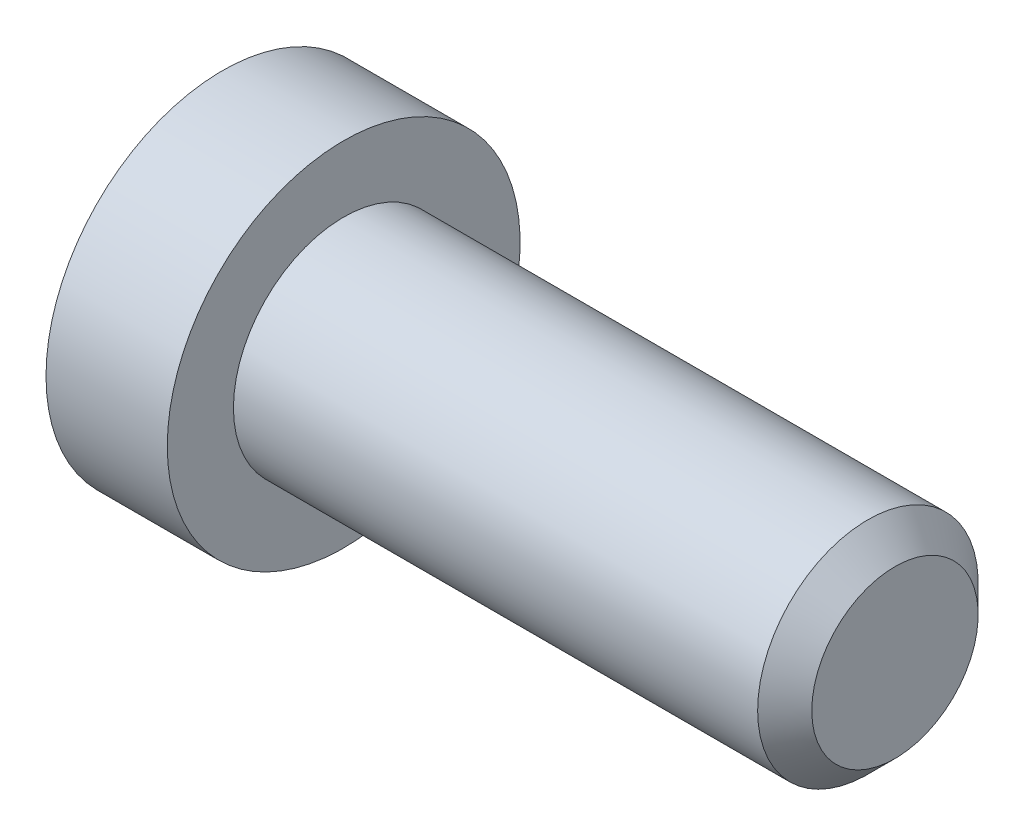
ISO-10303-21;
HEADER;
FILE_DESCRIPTION(('STEP AP214'),'2;1');
FILE_NAME('part.step','',(''),(''),'','','');
FILE_SCHEMA(('AUTOMOTIVE_DESIGN { 1 0 10303 214 1 1 1 1 }'));
ENDSEC;
DATA;
#1=APPLICATION_CONTEXT('core data for automotive mechanical design processes');
#2=APPLICATION_PROTOCOL_DEFINITION('international standard','automotive_design',2000,#1);
#3=PRODUCT_CONTEXT('',#1,'mechanical');
#4=PRODUCT('Part','Part','',(#3));
#5=PRODUCT_RELATED_PRODUCT_CATEGORY('part','',(#4));
#6=PRODUCT_DEFINITION_FORMATION('','',#4);
#7=PRODUCT_DEFINITION_CONTEXT('part definition',#1,'design');
#8=PRODUCT_DEFINITION('design','',#6,#7);
#9=PRODUCT_DEFINITION_SHAPE('','',#8);
#10=(LENGTH_UNIT() NAMED_UNIT(*) SI_UNIT(.MILLI.,.METRE.));
#11=(NAMED_UNIT(*) PLANE_ANGLE_UNIT() SI_UNIT($,.RADIAN.));
#12=(NAMED_UNIT(*) SI_UNIT($,.STERADIAN.) SOLID_ANGLE_UNIT());
#13=UNCERTAINTY_MEASURE_WITH_UNIT(LENGTH_MEASURE(1.E-05),#10,'distance_accuracy_value','');
#14=(GEOMETRIC_REPRESENTATION_CONTEXT(3) GLOBAL_UNCERTAINTY_ASSIGNED_CONTEXT((#13)) GLOBAL_UNIT_ASSIGNED_CONTEXT((#10,
#11,#12)) REPRESENTATION_CONTEXT('',''));
#15=CARTESIAN_POINT('',(0.,0.,0.));
#16=DIRECTION('',(0.,0.,1.));
#17=DIRECTION('',(1.,0.,0.));
#18=AXIS2_PLACEMENT_3D('',#15,#16,#17);
#19=CARTESIAN_POINT('',(-0.97,0.,0.));
#20=DIRECTION('',(-1.,0.,0.));
#21=DIRECTION('',(0.,0.,1.));
#22=AXIS2_PLACEMENT_3D('',#19,#20,#21);
#23=CONICAL_SURFACE('',#22,0.65,0.785398163397449);
#24=CARTESIAN_POINT('',(-1.1,0.,0.));
#25=DIRECTION('',(-1.,0.,0.));
#26=DIRECTION('',(0.,0.,1.));
#27=AXIS2_PLACEMENT_3D('',#24,#25,#26);
#28=CIRCLE('',#27,0.78);
#29=CARTESIAN_POINT('',(-1.1,0.,0.78));
#30=VERTEX_POINT('',#29);
#31=EDGE_CURVE('E227',#30,#30,#28,.T.);
#32=ORIENTED_EDGE('',*,*,#31,.T.);
#33=EDGE_LOOP('',(#32));
#34=FACE_BOUND('',#33,.T.);
#35=CARTESIAN_POINT('',(-1.07067084664318,0.750670820000348,-0.000200000000000034));
#36=CARTESIAN_POINT('',(-1.05777271213806,0.73776480399612,0.0221538754426204));
#37=CARTESIAN_POINT('',(-1.04563050484515,0.724643800275744,0.044880120532612));
#38=CARTESIAN_POINT('',(-1.02339759480874,0.697888312556701,0.0912219846432812));
#39=CARTESIAN_POINT('',(-1.01331927475652,0.684251279339144,0.114842019040595));
#40=CARTESIAN_POINT('',(-0.996056866369887,0.656751052753346,0.162473808706854));
#41=CARTESIAN_POINT('',(-0.988829308462092,0.642894902702,0.186473364593084));
#42=CARTESIAN_POINT('',(-0.97768455194652,0.614884150684731,0.234989410245206));
#43=CARTESIAN_POINT('',(-0.973759052568381,0.600730389323031,0.259504444041877));
#44=CARTESIAN_POINT('',(-0.96877878728122,0.566158679282904,0.319384402335916));
#45=CARTESIAN_POINT('',(-0.969679834739171,0.545659978891344,0.354889192903231));
#46=CARTESIAN_POINT('',(-0.978963911263182,0.505092254718528,0.42515455231799));
#47=CARTESIAN_POINT('',(-0.98735811297617,0.485023918403328,0.459913930439298));
#48=CARTESIAN_POINT('',(-1.00760102845381,0.449779956850421,0.520958262508936));
#49=CARTESIAN_POINT('',(-1.01839377321102,0.434442301170774,0.547523861415083));
#50=CARTESIAN_POINT('',(-1.04270728139612,0.404367956205631,0.599614154899066));
#51=CARTESIAN_POINT('',(-1.0562191709538,0.389629494831163,0.625141918825035));
#52=CARTESIAN_POINT('',(-1.07067084664319,0.375162204919422,0.6502));
#53=B_SPLINE_CURVE_WITH_KNOTS('',3,(#35,#36,#37,#38,#39,#40,#41,#42,#43,#44,#45,#46,#47,#48,#49,
#50,#51,#52),.UNSPECIFIED.,.F.,.F.,(4,2,2,2,2,2,2,2,4),(0.,0.0866236559063428,0.173752711623239,
0.259496442803563,0.345023980281746,0.467267720550118,0.589694037029328,0.687111308755475,
0.784215671813662),.UNSPECIFIED.);
#54=CARTESIAN_POINT('',(-1.07055534994651,0.75055534994651,0.));
#55=VERTEX_POINT('',#54);
#56=CARTESIAN_POINT('',(-1.07055534994651,0.37527767497326,0.65));
#57=VERTEX_POINT('',#56);
#58=EDGE_CURVE('E54',#55,#57,#53,.T.);
#59=ORIENTED_EDGE('',*,*,#58,.T.);
#60=CARTESIAN_POINT('',(-1.34698657134254,-0.795110946797934,0.65));
#61=CARTESIAN_POINT('',(-1.33215114259725,-0.775946306003986,0.65));
#62=CARTESIAN_POINT('',(-1.3174472939133,-0.756680121115909,0.65));
#63=CARTESIAN_POINT('',(-1.28835841074634,-0.717901876989154,0.65));
#64=CARTESIAN_POINT('',(-1.27397345032455,-0.6983897622505,0.65));
#65=CARTESIAN_POINT('',(-1.23117506241516,-0.639135200540149,0.65));
#66=CARTESIAN_POINT('',(-1.20334527350157,-0.598964394147309,0.65));
#67=CARTESIAN_POINT('',(-1.14826198934892,-0.514410757724497,0.65));
#68=CARTESIAN_POINT('',(-1.12116572431861,-0.46992440441247,0.65));
#69=CARTESIAN_POINT('',(-1.0712919728277,-0.378677329688828,0.65));
#70=CARTESIAN_POINT('',(-1.04849990079042,-0.331924989534033,0.65));
#71=CARTESIAN_POINT('',(-1.02060578904515,-0.262171836183639,0.65));
#72=CARTESIAN_POINT('',(-1.01268451768127,-0.240308902088551,0.65));
#73=CARTESIAN_POINT('',(-0.998588372872614,-0.196027368820283,0.65));
#74=CARTESIAN_POINT('',(-0.992413608004518,-0.173608735194612,0.65));
#75=CARTESIAN_POINT('',(-0.977262665972014,-0.106507355653642,0.65));
#76=CARTESIAN_POINT('',(-0.971270973089183,-0.0610734931701748,0.65));
#77=CARTESIAN_POINT('',(-0.96914985793265,0.0279224529824405,0.65));
#78=CARTESIAN_POINT('',(-0.972574981246003,0.0714733819315436,0.65));
#79=CARTESIAN_POINT('',(-0.983733142695104,0.136066508476408,0.65));
#80=CARTESIAN_POINT('',(-0.988531386792264,0.157677342437972,0.65));
#81=CARTESIAN_POINT('',(-0.999890236201741,0.20043000731548,0.65));
#82=CARTESIAN_POINT('',(-1.00645075830175,0.221571860325033,0.65));
#83=CARTESIAN_POINT('',(-1.02901876039986,0.286168508724034,0.65));
#84=CARTESIAN_POINT('',(-1.04751312457459,0.328748789016924,0.65));
#85=CARTESIAN_POINT('',(-1.08868123081028,0.411924938969468,0.65));
#86=CARTESIAN_POINT('',(-1.11136960894874,0.45251320906933,0.65));
#87=CARTESIAN_POINT('',(-1.15821231122604,0.530105416888655,0.65));
#88=CARTESIAN_POINT('',(-1.18223949226305,0.567187443274161,0.65));
#89=CARTESIAN_POINT('',(-1.23177090042578,0.639922078553566,0.65));
#90=CARTESIAN_POINT('',(-1.25726166991636,0.675583795890087,0.65));
#91=CARTESIAN_POINT('',(-1.28322807013493,0.710850416821895,0.65));
#92=B_SPLINE_CURVE_WITH_KNOTS('',3,(#60,#61,#62,#63,#64,#65,#66,#67,#68,#69,#70,#71,#72,#73,#74,
#75,#76,#77,#78,#79,#80,#81,#82,#83,#84,#85,#86,#87,#88,#89,#90,#91),.UNSPECIFIED.,.F.,.F.,(4,2,
2,2,2,2,2,2,2,2,2,2,2,2,2,4),(0.,0.0727056779992604,0.145428068505781,0.291977039828534,
0.44812796117937,0.603739848023543,0.673436680579368,0.743137845090119,0.879622453379847,
1.00976325017061,1.0761088480166,1.14245131366665,1.28132126625575,1.42068531737679,
1.55318895886601,1.68462520727467),.UNSPECIFIED.);
#93=CARTESIAN_POINT('',(-1.07055534994652,-0.37527767497326,0.65));
#94=VERTEX_POINT('',#93);
#95=EDGE_CURVE('E196',#57,#94,#92,.F.);
#96=ORIENTED_EDGE('',*,*,#95,.T.);
#97=CARTESIAN_POINT('',(-1.07067084664319,-0.375162204919422,0.6502));
#98=CARTESIAN_POINT('',(-1.05777271213806,-0.38806822092365,0.627846124557379));
#99=CARTESIAN_POINT('',(-1.04563050484515,-0.401189224644026,0.605119879467387));
#100=CARTESIAN_POINT('',(-1.02339759480874,-0.427944712363071,0.558778015356717));
#101=CARTESIAN_POINT('',(-1.01331927475652,-0.441581745580628,0.535157980959402));
#102=CARTESIAN_POINT('',(-0.996056866369889,-0.469081972166426,0.487526191293143));
#103=CARTESIAN_POINT('',(-0.988829308462093,-0.482938122217773,0.463526635406912));
#104=CARTESIAN_POINT('',(-0.97768455194652,-0.510948874235042,0.415010589754788));
#105=CARTESIAN_POINT('',(-0.973759052568381,-0.525102635596743,0.390495555958116));
#106=CARTESIAN_POINT('',(-0.96877878728122,-0.55967434563687,0.330615597664077));
#107=CARTESIAN_POINT('',(-0.969679834739171,-0.58017304602843,0.295110807096762));
#108=CARTESIAN_POINT('',(-0.978963911263182,-0.620740770201247,0.224845447682002));
#109=CARTESIAN_POINT('',(-0.987358112976169,-0.640809106516447,0.190086069560695));
#110=CARTESIAN_POINT('',(-1.00760102845381,-0.676053068069352,0.129041737491058));
#111=CARTESIAN_POINT('',(-1.01839377321101,-0.691390723748998,0.102476138584913));
#112=CARTESIAN_POINT('',(-1.04270728139611,-0.721465068714141,0.0503858451009323));
#113=CARTESIAN_POINT('',(-1.0562191709538,-0.736203530088608,0.0248580811749638));
#114=CARTESIAN_POINT('',(-1.07067084664318,-0.750670820000348,-0.000200000000000006));
#115=B_SPLINE_CURVE_WITH_KNOTS('',3,(#97,#98,#99,#100,#101,#102,#103,#104,#105,#106,#107,#108,
#109,#110,#111,#112,#113,#114),.UNSPECIFIED.,.F.,.F.,(4,2,2,2,2,2,2,2,4),(0.,0.086623655906345,
0.173752711623244,0.25949644280357,0.345023980281755,0.467267720550128,0.589694037029338,
0.68711130875548,0.784215671813662),.UNSPECIFIED.);
#116=CARTESIAN_POINT('',(-1.07055534994651,-0.75055534994651,0.));
#117=VERTEX_POINT('',#116);
#118=EDGE_CURVE('E140',#94,#117,#115,.T.);
#119=ORIENTED_EDGE('',*,*,#118,.T.);
#120=CARTESIAN_POINT('',(-1.07067084664318,-0.750670820000348,0.000200000000000034));
#121=CARTESIAN_POINT('',(-1.05777271213806,-0.73776480399612,-0.0221538754426204));
#122=CARTESIAN_POINT('',(-1.04563050484515,-0.724643800275744,-0.044880120532612));
#123=CARTESIAN_POINT('',(-1.02339759480874,-0.697888312556701,-0.0912219846432812));
#124=CARTESIAN_POINT('',(-1.01331927475652,-0.684251279339144,-0.114842019040595));
#125=CARTESIAN_POINT('',(-0.996056866369887,-0.656751052753346,-0.162473808706854));
#126=CARTESIAN_POINT('',(-0.988829308462092,-0.642894902702,-0.186473364593084));
#127=CARTESIAN_POINT('',(-0.97768455194652,-0.614884150684731,-0.234989410245206));
#128=CARTESIAN_POINT('',(-0.973759052568381,-0.600730389323031,-0.259504444041877));
#129=CARTESIAN_POINT('',(-0.96877878728122,-0.566158679282904,-0.319384402335916));
#130=CARTESIAN_POINT('',(-0.969679834739171,-0.545659978891344,-0.354889192903231));
#131=CARTESIAN_POINT('',(-0.978963911263182,-0.505092254718528,-0.42515455231799));
#132=CARTESIAN_POINT('',(-0.98735811297617,-0.485023918403328,-0.459913930439298));
#133=CARTESIAN_POINT('',(-1.00760102845381,-0.449779956850421,-0.520958262508936));
#134=CARTESIAN_POINT('',(-1.01839377321102,-0.434442301170774,-0.547523861415083));
#135=CARTESIAN_POINT('',(-1.04270728139612,-0.404367956205631,-0.599614154899066));
#136=CARTESIAN_POINT('',(-1.0562191709538,-0.389629494831163,-0.625141918825035));
#137=CARTESIAN_POINT('',(-1.07067084664319,-0.375162204919422,-0.6502));
#138=B_SPLINE_CURVE_WITH_KNOTS('',3,(#120,#121,#122,#123,#124,#125,#126,#127,#128,#129,#130,
#131,#132,#133,#134,#135,#136,#137),.UNSPECIFIED.,.F.,.F.,(4,2,2,2,2,2,2,2,4),(0.,
0.0866236559063428,0.173752711623239,0.259496442803563,0.345023980281746,0.467267720550118,
0.589694037029328,0.687111308755475,0.784215671813662),.UNSPECIFIED.);
#139=CARTESIAN_POINT('',(-1.07055534994652,-0.37527767497326,-0.65));
#140=VERTEX_POINT('',#139);
#141=EDGE_CURVE('E187',#117,#140,#138,.T.);
#142=ORIENTED_EDGE('',*,*,#141,.T.);
#143=CARTESIAN_POINT('',(-1.34698657134254,-0.795110946797934,-0.65));
#144=CARTESIAN_POINT('',(-1.33215114259725,-0.775946306003986,-0.65));
#145=CARTESIAN_POINT('',(-1.3174472939133,-0.756680121115909,-0.65));
#146=CARTESIAN_POINT('',(-1.28835841074634,-0.717901876989154,-0.65));
#147=CARTESIAN_POINT('',(-1.27397345032455,-0.6983897622505,-0.65));
#148=CARTESIAN_POINT('',(-1.23117506241516,-0.639135200540149,-0.65));
#149=CARTESIAN_POINT('',(-1.20334527350157,-0.598964394147309,-0.65));
#150=CARTESIAN_POINT('',(-1.14826198934892,-0.514410757724497,-0.65));
#151=CARTESIAN_POINT('',(-1.12116572431861,-0.46992440441247,-0.65));
#152=CARTESIAN_POINT('',(-1.0712919728277,-0.378677329688828,-0.65));
#153=CARTESIAN_POINT('',(-1.04849990079042,-0.331924989534033,-0.65));
#154=CARTESIAN_POINT('',(-1.02060578904515,-0.262171836183639,-0.65));
#155=CARTESIAN_POINT('',(-1.01268451768127,-0.240308902088551,-0.65));
#156=CARTESIAN_POINT('',(-0.998588372872614,-0.196027368820283,-0.65));
#157=CARTESIAN_POINT('',(-0.992413608004518,-0.173608735194612,-0.65));
#158=CARTESIAN_POINT('',(-0.977262665972014,-0.106507355653642,-0.65));
#159=CARTESIAN_POINT('',(-0.971270973089183,-0.0610734931701748,-0.65));
#160=CARTESIAN_POINT('',(-0.96914985793265,0.0279224529824405,-0.65));
#161=CARTESIAN_POINT('',(-0.972574981246003,0.0714733819315436,-0.65));
#162=CARTESIAN_POINT('',(-0.983733142695104,0.136066508476408,-0.65));
#163=CARTESIAN_POINT('',(-0.988531386792264,0.157677342437972,-0.65));
#164=CARTESIAN_POINT('',(-0.999890236201741,0.20043000731548,-0.65));
#165=CARTESIAN_POINT('',(-1.00645075830175,0.221571860325033,-0.65));
#166=CARTESIAN_POINT('',(-1.02901876039986,0.286168508724034,-0.65));
#167=CARTESIAN_POINT('',(-1.04751312457459,0.328748789016924,-0.65));
#168=CARTESIAN_POINT('',(-1.08868123081028,0.411924938969468,-0.65));
#169=CARTESIAN_POINT('',(-1.11136960894874,0.45251320906933,-0.65));
#170=CARTESIAN_POINT('',(-1.15821231122604,0.530105416888655,-0.65));
#171=CARTESIAN_POINT('',(-1.18223949226305,0.567187443274161,-0.65));
#172=CARTESIAN_POINT('',(-1.23177090042578,0.639922078553566,-0.65));
#173=CARTESIAN_POINT('',(-1.25726166991636,0.675583795890087,-0.65));
#174=CARTESIAN_POINT('',(-1.28322807013493,0.710850416821895,-0.65));
#175=B_SPLINE_CURVE_WITH_KNOTS('',3,(#143,#144,#145,#146,#147,#148,#149,#150,#151,#152,#153,
#154,#155,#156,#157,#158,#159,#160,#161,#162,#163,#164,#165,#166,#167,#168,#169,#170,#171,#172,
#173,#174),.UNSPECIFIED.,.F.,.F.,(4,2,2,2,2,2,2,2,2,2,2,2,2,2,2,4),(0.,0.0727056779992604,
0.145428068505781,0.291977039828534,0.44812796117937,0.603739848023543,0.673436680579368,
0.743137845090119,0.879622453379847,1.00976325017061,1.0761088480166,1.14245131366665,
1.28132126625575,1.42068531737679,1.55318895886601,1.68462520727467),.UNSPECIFIED.);
#176=CARTESIAN_POINT('',(-1.07055534994652,0.37527767497326,-0.65));
#177=VERTEX_POINT('',#176);
#178=EDGE_CURVE('E182',#140,#177,#175,.T.);
#179=ORIENTED_EDGE('',*,*,#178,.T.);
#180=CARTESIAN_POINT('',(-1.07067084664319,0.375162204919422,-0.6502));
#181=CARTESIAN_POINT('',(-1.05777271213806,0.38806822092365,-0.627846124557379));
#182=CARTESIAN_POINT('',(-1.04563050484515,0.401189224644026,-0.605119879467387));
#183=CARTESIAN_POINT('',(-1.02339759480874,0.427944712363071,-0.558778015356717));
#184=CARTESIAN_POINT('',(-1.01331927475652,0.441581745580628,-0.535157980959402));
#185=CARTESIAN_POINT('',(-0.996056866369889,0.469081972166426,-0.487526191293143));
#186=CARTESIAN_POINT('',(-0.988829308462093,0.482938122217773,-0.463526635406912));
#187=CARTESIAN_POINT('',(-0.97768455194652,0.510948874235042,-0.415010589754788));
#188=CARTESIAN_POINT('',(-0.973759052568381,0.525102635596743,-0.390495555958116));
#189=CARTESIAN_POINT('',(-0.96877878728122,0.55967434563687,-0.330615597664077));
#190=CARTESIAN_POINT('',(-0.969679834739171,0.58017304602843,-0.295110807096762));
#191=CARTESIAN_POINT('',(-0.978963911263182,0.620740770201247,-0.224845447682002));
#192=CARTESIAN_POINT('',(-0.987358112976169,0.640809106516447,-0.190086069560695));
#193=CARTESIAN_POINT('',(-1.00760102845381,0.676053068069352,-0.129041737491058));
#194=CARTESIAN_POINT('',(-1.01839377321101,0.691390723748998,-0.102476138584913));
#195=CARTESIAN_POINT('',(-1.04270728139611,0.721465068714141,-0.0503858451009323));
#196=CARTESIAN_POINT('',(-1.0562191709538,0.736203530088608,-0.0248580811749638));
#197=CARTESIAN_POINT('',(-1.07067084664318,0.750670820000348,0.000200000000000006));
#198=B_SPLINE_CURVE_WITH_KNOTS('',3,(#180,#181,#182,#183,#184,#185,#186,#187,#188,#189,#190,
#191,#192,#193,#194,#195,#196,#197),.UNSPECIFIED.,.F.,.F.,(4,2,2,2,2,2,2,2,4),(0.,
0.086623655906345,0.173752711623244,0.25949644280357,0.345023980281755,0.467267720550128,
0.589694037029338,0.68711130875548,0.784215671813662),.UNSPECIFIED.);
#199=EDGE_CURVE('E143',#177,#55,#198,.T.);
#200=ORIENTED_EDGE('',*,*,#199,.T.);
#201=EDGE_LOOP('',(#59,#96,#119,#142,#179,#200));
#202=FACE_BOUND('',#201,.T.);
#203=ADVANCED_FACE('F39',(#34,#202),#23,.F.);
#204=CARTESIAN_POINT('',(-1.1,0.,0.));
#205=DIRECTION('',(1.,0.,0.));
#206=DIRECTION('',(0.,0.,-1.));
#207=AXIS2_PLACEMENT_3D('',#204,#205,#206);
#208=PLANE('',#207);
#209=CARTESIAN_POINT('',(-1.1,0.,0.));
#210=DIRECTION('',(-1.,0.,0.));
#211=DIRECTION('',(0.,0.,1.));
#212=AXIS2_PLACEMENT_3D('',#209,#210,#211);
#213=CIRCLE('',#212,1.6);
#214=CARTESIAN_POINT('',(-1.1,0.,1.6));
#215=VERTEX_POINT('',#214);
#216=EDGE_CURVE('E233',#215,#215,#213,.T.);
#217=ORIENTED_EDGE('',*,*,#216,.T.);
#218=EDGE_LOOP('',(#217));
#219=FACE_BOUND('',#218,.T.);
#220=ORIENTED_EDGE('',*,*,#31,.F.);
#221=EDGE_LOOP('',(#220));
#222=FACE_BOUND('',#221,.T.);
#223=ADVANCED_FACE('F218',(#219,#222),#208,.F.);
#224=CARTESIAN_POINT('',(5.,0.,0.));
#225=DIRECTION('',(-1.,0.,0.));
#226=DIRECTION('',(0.,0.,1.));
#227=AXIS2_PLACEMENT_3D('',#224,#225,#226);
#228=CYLINDRICAL_SURFACE('',#227,1.);
#229=CARTESIAN_POINT('',(0.,0.,0.));
#230=DIRECTION('',(-1.,0.,0.));
#231=DIRECTION('',(0.,0.,1.));
#232=AXIS2_PLACEMENT_3D('',#229,#230,#231);
#233=CIRCLE('',#232,1.);
#234=CARTESIAN_POINT('',(0.,0.,1.));
#235=VERTEX_POINT('',#234);
#236=EDGE_CURVE('E11',#235,#235,#233,.T.);
#237=ORIENTED_EDGE('',*,*,#236,.F.);
#238=EDGE_LOOP('',(#237));
#239=FACE_BOUND('',#238,.T.);
#240=CARTESIAN_POINT('',(4.7545,0.,0.));
#241=DIRECTION('',(-1.,0.,0.));
#242=DIRECTION('',(0.,0.,1.));
#243=AXIS2_PLACEMENT_3D('',#240,#241,#242);
#244=CIRCLE('',#243,1.);
#245=CARTESIAN_POINT('',(4.7545,0.,1.));
#246=VERTEX_POINT('',#245);
#247=EDGE_CURVE('E47',#246,#246,#244,.T.);
#248=ORIENTED_EDGE('',*,*,#247,.T.);
#249=EDGE_LOOP('',(#248));
#250=FACE_BOUND('',#249,.T.);
#251=ADVANCED_FACE('F41',(#239,#250),#228,.T.);
#252=CARTESIAN_POINT('',(5.,0.,0.));
#253=DIRECTION('',(-1.,0.,0.));
#254=DIRECTION('',(0.,0.,1.));
#255=AXIS2_PLACEMENT_3D('',#252,#253,#254);
#256=CONICAL_SURFACE('',#255,0.7545,0.785398163397448);
#257=ORIENTED_EDGE('',*,*,#247,.F.);
#258=EDGE_LOOP('',(#257));
#259=FACE_BOUND('',#258,.T.);
#260=CARTESIAN_POINT('',(5.,0.,0.));
#261=DIRECTION('',(-1.,0.,0.));
#262=DIRECTION('',(0.,0.,1.));
#263=AXIS2_PLACEMENT_3D('',#260,#261,#262);
#264=CIRCLE('',#263,0.7545);
#265=CARTESIAN_POINT('',(5.,0.,0.7545));
#266=VERTEX_POINT('',#265);
#267=EDGE_CURVE('E239',#266,#266,#264,.T.);
#268=ORIENTED_EDGE('',*,*,#267,.T.);
#269=EDGE_LOOP('',(#268));
#270=FACE_BOUND('',#269,.T.);
#271=ADVANCED_FACE('F245',(#259,#270),#256,.T.);
#272=CARTESIAN_POINT('',(5.,0.7545,0.));
#273=DIRECTION('',(-1.,0.,0.));
#274=DIRECTION('',(0.,0.,1.));
#275=AXIS2_PLACEMENT_3D('',#272,#273,#274);
#276=PLANE('',#275);
#277=ORIENTED_EDGE('',*,*,#267,.F.);
#278=EDGE_LOOP('',(#277));
#279=FACE_BOUND('',#278,.T.);
#280=ADVANCED_FACE('F248',(#279),#276,.F.);
#281=CARTESIAN_POINT('',(0.,1.6,0.));
#282=DIRECTION('',(-1.,0.,0.));
#283=DIRECTION('',(0.,0.,1.));
#284=AXIS2_PLACEMENT_3D('',#281,#282,#283);
#285=PLANE('',#284);
#286=CARTESIAN_POINT('',(0.,0.,0.));
#287=DIRECTION('',(-1.,0.,0.));
#288=DIRECTION('',(0.,0.,1.));
#289=AXIS2_PLACEMENT_3D('',#286,#287,#288);
#290=CIRCLE('',#289,1.6);
#291=CARTESIAN_POINT('',(0.,0.,1.6));
#292=VERTEX_POINT('',#291);
#293=EDGE_CURVE('E229',#292,#292,#290,.T.);
#294=ORIENTED_EDGE('',*,*,#293,.F.);
#295=EDGE_LOOP('',(#294));
#296=FACE_BOUND('',#295,.T.);
#297=ORIENTED_EDGE('',*,*,#236,.T.);
#298=EDGE_LOOP('',(#297));
#299=FACE_BOUND('',#298,.T.);
#300=ADVANCED_FACE('F252',(#296,#299),#285,.F.);
#301=CARTESIAN_POINT('',(0.,0.,0.));
#302=DIRECTION('',(-1.,0.,0.));
#303=DIRECTION('',(0.,0.,1.));
#304=AXIS2_PLACEMENT_3D('',#301,#302,#303);
#305=CYLINDRICAL_SURFACE('',#304,1.6);
#306=ORIENTED_EDGE('',*,*,#216,.F.);
#307=EDGE_LOOP('',(#306));
#308=FACE_BOUND('',#307,.T.);
#309=ORIENTED_EDGE('',*,*,#293,.T.);
#310=EDGE_LOOP('',(#309));
#311=FACE_BOUND('',#310,.T.);
#312=ADVANCED_FACE('F206',(#308,#311),#305,.T.);
#313=CARTESIAN_POINT('',(0.0999999999999998,0.37527767497326,0.65));
#314=DIRECTION('',(0.,0.,-1.));
#315=DIRECTION('',(-1.,0.,0.));
#316=AXIS2_PLACEMENT_3D('',#313,#314,#315);
#317=PLANE('',#316);
#318=DIRECTION('',(-1.,0.,0.));
#319=VECTOR('',#318,1.);
#320=CARTESIAN_POINT('',(0.0999999999999998,0.37527767497326,0.65));
#321=LINE('',#320,#319);
#322=CARTESIAN_POINT('',(0.0999999999999998,0.37527767497326,0.65));
#323=VERTEX_POINT('',#322);
#324=EDGE_CURVE('E417',#323,#57,#321,.T.);
#325=ORIENTED_EDGE('',*,*,#324,.F.);
#326=DIRECTION('',(0.,-1.,0.));
#327=VECTOR('',#326,1.);
#328=CARTESIAN_POINT('',(0.0999999999999998,0.37527767497326,0.65));
#329=LINE('',#328,#327);
#330=CARTESIAN_POINT('',(0.0999999999999998,0.,0.65));
#331=VERTEX_POINT('',#330);
#332=EDGE_CURVE('E123',#323,#331,#329,.T.);
#333=ORIENTED_EDGE('',*,*,#332,.T.);
#334=CARTESIAN_POINT('',(0.0999999999999998,-0.37527767497326,0.65));
#335=VERTEX_POINT('',#334);
#336=EDGE_CURVE('E115',#331,#335,#329,.T.);
#337=ORIENTED_EDGE('',*,*,#336,.T.);
#338=DIRECTION('',(-1.,0.,0.));
#339=VECTOR('',#338,1.);
#340=CARTESIAN_POINT('',(0.0999999999999998,-0.37527767497326,0.65));
#341=LINE('',#340,#339);
#342=EDGE_CURVE('E121',#335,#94,#341,.T.);
#343=ORIENTED_EDGE('',*,*,#342,.T.);
#344=ORIENTED_EDGE('',*,*,#95,.F.);
#345=EDGE_LOOP('',(#325,#333,#337,#343,#344));
#346=FACE_BOUND('',#345,.T.);
#347=ADVANCED_FACE('F118',(#346),#317,.T.);
#348=CARTESIAN_POINT('',(0.0999999999999998,-0.37527767497326,0.65));
#349=DIRECTION('',(0.,0.866025403784443,-0.499999999999993));
#350=DIRECTION('',(0.,0.499999999999993,0.866025403784442));
#351=AXIS2_PLACEMENT_3D('',#348,#349,#350);
#352=PLANE('',#351);
#353=ORIENTED_EDGE('',*,*,#342,.F.);
#354=DIRECTION('',(0.,-0.499999999999993,-0.866025403784442));
#355=VECTOR('',#354,1.);
#356=CARTESIAN_POINT('',(0.0999999999999998,-0.37527767497326,0.65));
#357=LINE('',#356,#355);
#358=CARTESIAN_POINT('',(0.0999999999999998,-0.562916512459887,0.324999999999996));
#359=VERTEX_POINT('',#358);
#360=EDGE_CURVE('E128',#335,#359,#357,.T.);
#361=ORIENTED_EDGE('',*,*,#360,.T.);
#362=CARTESIAN_POINT('',(0.0999999999999998,-0.75055534994651,0.));
#363=VERTEX_POINT('',#362);
#364=EDGE_CURVE('E135',#359,#363,#357,.T.);
#365=ORIENTED_EDGE('',*,*,#364,.T.);
#366=DIRECTION('',(-1.,0.,0.));
#367=VECTOR('',#366,1.);
#368=CARTESIAN_POINT('',(0.0999999999999998,-0.75055534994651,0.));
#369=LINE('',#368,#367);
#370=EDGE_CURVE('E141',#363,#117,#369,.T.);
#371=ORIENTED_EDGE('',*,*,#370,.T.);
#372=ORIENTED_EDGE('',*,*,#118,.F.);
#373=EDGE_LOOP('',(#353,#361,#365,#371,#372));
#374=FACE_BOUND('',#373,.T.);
#375=ADVANCED_FACE('F138',(#374),#352,.T.);
#376=CARTESIAN_POINT('',(0.0999999999999998,-0.75055534994651,0.));
#377=DIRECTION('',(0.,0.866025403784443,0.499999999999993));
#378=DIRECTION('',(0.,-0.499999999999993,0.866025403784442));
#379=AXIS2_PLACEMENT_3D('',#376,#377,#378);
#380=PLANE('',#379);
#381=ORIENTED_EDGE('',*,*,#370,.F.);
#382=DIRECTION('',(0.,0.499999999999993,-0.866025403784442));
#383=VECTOR('',#382,1.);
#384=CARTESIAN_POINT('',(0.0999999999999998,-0.75055534994651,0.));
#385=LINE('',#384,#383);
#386=CARTESIAN_POINT('',(0.1,-0.562916512459888,-0.324999999999996));
#387=VERTEX_POINT('',#386);
#388=EDGE_CURVE('E62',#363,#387,#385,.T.);
#389=ORIENTED_EDGE('',*,*,#388,.T.);
#390=CARTESIAN_POINT('',(0.0999999999999998,-0.37527767497326,-0.65));
#391=VERTEX_POINT('',#390);
#392=EDGE_CURVE('E134',#387,#391,#385,.T.);
#393=ORIENTED_EDGE('',*,*,#392,.T.);
#394=DIRECTION('',(-1.,0.,0.));
#395=VECTOR('',#394,1.);
#396=CARTESIAN_POINT('',(0.0999999999999998,-0.37527767497326,-0.65));
#397=LINE('',#396,#395);
#398=EDGE_CURVE('E145',#391,#140,#397,.T.);
#399=ORIENTED_EDGE('',*,*,#398,.T.);
#400=ORIENTED_EDGE('',*,*,#141,.F.);
#401=EDGE_LOOP('',(#381,#389,#393,#399,#400));
#402=FACE_BOUND('',#401,.T.);
#403=ADVANCED_FACE('F178',(#402),#380,.T.);
#404=CARTESIAN_POINT('',(0.0999999999999998,-0.37527767497326,-0.65));
#405=DIRECTION('',(0.,0.,1.));
#406=DIRECTION('',(1.,0.,0.));
#407=AXIS2_PLACEMENT_3D('',#404,#405,#406);
#408=PLANE('',#407);
#409=ORIENTED_EDGE('',*,*,#398,.F.);
#410=DIRECTION('',(0.,1.,0.));
#411=VECTOR('',#410,1.);
#412=CARTESIAN_POINT('',(0.0999999999999998,-0.37527767497326,-0.65));
#413=LINE('',#412,#411);
#414=CARTESIAN_POINT('',(0.0999999999999998,0.,-0.65));
#415=VERTEX_POINT('',#414);
#416=EDGE_CURVE('E430',#391,#415,#413,.T.);
#417=ORIENTED_EDGE('',*,*,#416,.T.);
#418=CARTESIAN_POINT('',(0.0999999999999998,0.37527767497326,-0.65));
#419=VERTEX_POINT('',#418);
#420=EDGE_CURVE('E431',#415,#419,#413,.T.);
#421=ORIENTED_EDGE('',*,*,#420,.T.);
#422=DIRECTION('',(-1.,0.,0.));
#423=VECTOR('',#422,1.);
#424=CARTESIAN_POINT('',(0.0999999999999998,0.37527767497326,-0.65));
#425=LINE('',#424,#423);
#426=EDGE_CURVE('E423',#419,#177,#425,.T.);
#427=ORIENTED_EDGE('',*,*,#426,.T.);
#428=ORIENTED_EDGE('',*,*,#178,.F.);
#429=EDGE_LOOP('',(#409,#417,#421,#427,#428));
#430=FACE_BOUND('',#429,.T.);
#431=ADVANCED_FACE('F173',(#430),#408,.T.);
#432=CARTESIAN_POINT('',(0.0999999999999998,0.37527767497326,-0.65));
#433=DIRECTION('',(0.,-0.866025403784443,0.499999999999993));
#434=DIRECTION('',(0.,-0.499999999999993,-0.866025403784442));
#435=AXIS2_PLACEMENT_3D('',#432,#433,#434);
#436=PLANE('',#435);
#437=ORIENTED_EDGE('',*,*,#426,.F.);
#438=DIRECTION('',(0.,0.499999999999993,0.866025403784442));
#439=VECTOR('',#438,1.);
#440=CARTESIAN_POINT('',(0.0999999999999998,0.37527767497326,-0.65));
#441=LINE('',#440,#439);
#442=CARTESIAN_POINT('',(0.0999999999999998,0.562916512459887,-0.324999999999996));
#443=VERTEX_POINT('',#442);
#444=EDGE_CURVE('E412',#419,#443,#441,.T.);
#445=ORIENTED_EDGE('',*,*,#444,.T.);
#446=CARTESIAN_POINT('',(0.0999999999999998,0.75055534994651,0.));
#447=VERTEX_POINT('',#446);
#448=EDGE_CURVE('E409',#443,#447,#441,.T.);
#449=ORIENTED_EDGE('',*,*,#448,.T.);
#450=DIRECTION('',(-1.,0.,0.));
#451=VECTOR('',#450,1.);
#452=CARTESIAN_POINT('',(0.0999999999999998,0.75055534994651,0.));
#453=LINE('',#452,#451);
#454=EDGE_CURVE('E416',#447,#55,#453,.T.);
#455=ORIENTED_EDGE('',*,*,#454,.T.);
#456=ORIENTED_EDGE('',*,*,#199,.F.);
#457=EDGE_LOOP('',(#437,#445,#449,#455,#456));
#458=FACE_BOUND('',#457,.T.);
#459=ADVANCED_FACE('F167',(#458),#436,.T.);
#460=CARTESIAN_POINT('',(0.0999999999999998,0.75055534994651,0.));
#461=DIRECTION('',(0.,-0.866025403784443,-0.499999999999993));
#462=DIRECTION('',(0.,0.499999999999993,-0.866025403784442));
#463=AXIS2_PLACEMENT_3D('',#460,#461,#462);
#464=PLANE('',#463);
#465=ORIENTED_EDGE('',*,*,#454,.F.);
#466=DIRECTION('',(0.,-0.499999999999993,0.866025403784442));
#467=VECTOR('',#466,1.);
#468=CARTESIAN_POINT('',(0.0999999999999998,0.75055534994651,0.));
#469=LINE('',#468,#467);
#470=CARTESIAN_POINT('',(0.0999999999999998,0.562916512459887,0.324999999999996));
#471=VERTEX_POINT('',#470);
#472=EDGE_CURVE('E408',#447,#471,#469,.T.);
#473=ORIENTED_EDGE('',*,*,#472,.T.);
#474=EDGE_CURVE('E411',#471,#323,#469,.T.);
#475=ORIENTED_EDGE('',*,*,#474,.T.);
#476=ORIENTED_EDGE('',*,*,#324,.T.);
#477=ORIENTED_EDGE('',*,*,#58,.F.);
#478=EDGE_LOOP('',(#465,#473,#475,#476,#477));
#479=FACE_BOUND('',#478,.T.);
#480=ADVANCED_FACE('F162',(#479),#464,.T.);
#481=CARTESIAN_POINT('',(0.0999999999999998,0.,0.));
#482=DIRECTION('',(1.,0.,0.));
#483=DIRECTION('',(0.,0.,-1.));
#484=AXIS2_PLACEMENT_3D('',#481,#482,#483);
#485=PLANE('',#484);
#486=CARTESIAN_POINT('',(0.1,0.,0.));
#487=DIRECTION('',(-1.,0.,0.));
#488=DIRECTION('',(0.,0.,1.));
#489=AXIS2_PLACEMENT_3D('',#486,#487,#488);
#490=CIRCLE('',#489,0.65);
#491=EDGE_CURVE('E401',#443,#415,#490,.T.);
#492=ORIENTED_EDGE('',*,*,#491,.F.);
#493=ORIENTED_EDGE('',*,*,#444,.F.);
#494=ORIENTED_EDGE('',*,*,#420,.F.);
#495=EDGE_LOOP('',(#492,#493,#494));
#496=FACE_BOUND('',#495,.T.);
#497=ADVANCED_FACE('F166',(#496),#485,.F.);
#498=EDGE_CURVE('E235',#471,#443,#490,.T.);
#499=ORIENTED_EDGE('',*,*,#498,.F.);
#500=ORIENTED_EDGE('',*,*,#472,.F.);
#501=ORIENTED_EDGE('',*,*,#448,.F.);
#502=EDGE_LOOP('',(#499,#500,#501));
#503=FACE_BOUND('',#502,.T.);
#504=ADVANCED_FACE('F350',(#503),#485,.F.);
#505=EDGE_CURVE('E230',#331,#471,#490,.T.);
#506=ORIENTED_EDGE('',*,*,#505,.F.);
#507=ORIENTED_EDGE('',*,*,#332,.F.);
#508=ORIENTED_EDGE('',*,*,#474,.F.);
#509=EDGE_LOOP('',(#506,#507,#508));
#510=FACE_BOUND('',#509,.T.);
#511=ADVANCED_FACE('F359',(#510),#485,.F.);
#512=EDGE_CURVE('E130',#359,#331,#490,.T.);
#513=ORIENTED_EDGE('',*,*,#512,.F.);
#514=ORIENTED_EDGE('',*,*,#360,.F.);
#515=ORIENTED_EDGE('',*,*,#336,.F.);
#516=EDGE_LOOP('',(#513,#514,#515));
#517=FACE_BOUND('',#516,.T.);
#518=ADVANCED_FACE('F129',(#517),#485,.F.);
#519=EDGE_CURVE('E396',#387,#359,#490,.T.);
#520=ORIENTED_EDGE('',*,*,#519,.F.);
#521=ORIENTED_EDGE('',*,*,#388,.F.);
#522=ORIENTED_EDGE('',*,*,#364,.F.);
#523=EDGE_LOOP('',(#520,#521,#522));
#524=FACE_BOUND('',#523,.T.);
#525=ADVANCED_FACE('F213',(#524),#485,.F.);
#526=EDGE_CURVE('E398',#415,#387,#490,.T.);
#527=ORIENTED_EDGE('',*,*,#526,.F.);
#528=ORIENTED_EDGE('',*,*,#416,.F.);
#529=ORIENTED_EDGE('',*,*,#392,.F.);
#530=EDGE_LOOP('',(#527,#528,#529));
#531=FACE_BOUND('',#530,.T.);
#532=ADVANCED_FACE('F169',(#531),#485,.F.);
#533=CARTESIAN_POINT('',(0.47527767497326,0.,0.));
#534=DIRECTION('',(-1.,0.,0.));
#535=DIRECTION('',(0.,0.,1.));
#536=AXIS2_PLACEMENT_3D('',#533,#534,#535);
#537=CONICAL_SURFACE('',#536,0.,1.04719755119659);
#538=ORIENTED_EDGE('',*,*,#505,.T.);
#539=ORIENTED_EDGE('',*,*,#498,.T.);
#540=ORIENTED_EDGE('',*,*,#491,.T.);
#541=ORIENTED_EDGE('',*,*,#526,.T.);
#542=ORIENTED_EDGE('',*,*,#519,.T.);
#543=ORIENTED_EDGE('',*,*,#512,.T.);
#544=EDGE_LOOP('',(#538,#539,#540,#541,#542,#543));
#545=FACE_BOUND('',#544,.T.);
#546=CARTESIAN_POINT('',(0.47527767497326,0.,0.));
#547=VERTEX_POINT('',#546);
#548=VERTEX_LOOP('',#547);
#549=FACE_BOUND('',#548,.T.);
#550=ADVANCED_FACE('F207',(#545,#549),#537,.F.);
#551=CLOSED_SHELL('',(#203,#223,#251,#271,#280,#300,#312,#347,#375,#403,#431,#459,#480,#497,
#504,#511,#518,#525,#532,#550));
#552=MANIFOLD_SOLID_BREP('B2',#551);
#553=ADVANCED_BREP_SHAPE_REPRESENTATION('',(#18,#552),#14);
#554=SHAPE_DEFINITION_REPRESENTATION(#9,#553);
ENDSEC;
END-ISO-10303-21;
